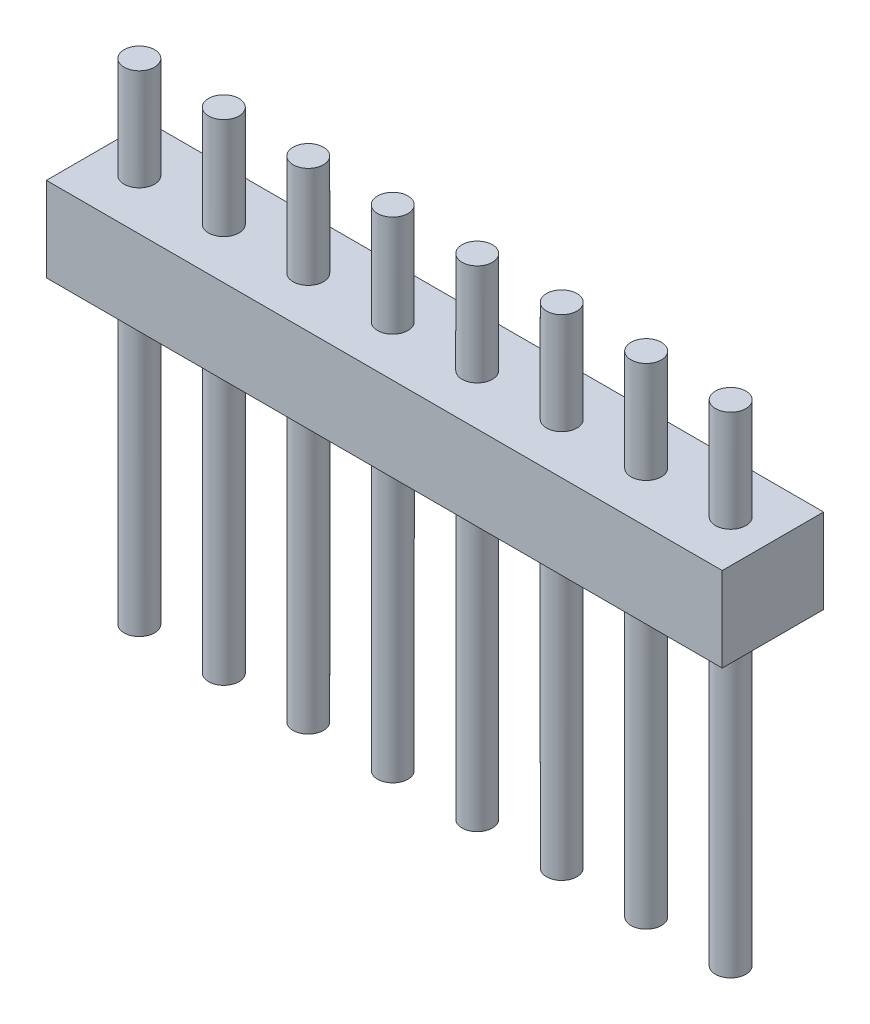
ISO-10303-21;
HEADER;
FILE_DESCRIPTION(('STEP AP214'),'2;1');
FILE_NAME('part.step','',(''),(''),'','','');
FILE_SCHEMA(('AUTOMOTIVE_DESIGN { 1 0 10303 214 1 1 1 1 }'));
ENDSEC;
DATA;
#1=APPLICATION_CONTEXT('core data for automotive mechanical design processes');
#2=APPLICATION_PROTOCOL_DEFINITION('international standard','automotive_design',2000,#1);
#3=PRODUCT_CONTEXT('',#1,'mechanical');
#4=PRODUCT('Part','Part','',(#3));
#5=PRODUCT_RELATED_PRODUCT_CATEGORY('part','',(#4));
#6=PRODUCT_DEFINITION_FORMATION('','',#4);
#7=PRODUCT_DEFINITION_CONTEXT('part definition',#1,'design');
#8=PRODUCT_DEFINITION('design','',#6,#7);
#9=PRODUCT_DEFINITION_SHAPE('','',#8);
#10=(LENGTH_UNIT() NAMED_UNIT(*) SI_UNIT(.MILLI.,.METRE.));
#11=(NAMED_UNIT(*) PLANE_ANGLE_UNIT() SI_UNIT($,.RADIAN.));
#12=(NAMED_UNIT(*) SI_UNIT($,.STERADIAN.) SOLID_ANGLE_UNIT());
#13=UNCERTAINTY_MEASURE_WITH_UNIT(LENGTH_MEASURE(1.E-05),#10,'distance_accuracy_value','');
#14=(GEOMETRIC_REPRESENTATION_CONTEXT(3) GLOBAL_UNCERTAINTY_ASSIGNED_CONTEXT((#13)) GLOBAL_UNIT_ASSIGNED_CONTEXT((#10,
#11,#12)) REPRESENTATION_CONTEXT('',''));
#15=CARTESIAN_POINT('',(0.,0.,0.));
#16=DIRECTION('',(0.,0.,1.));
#17=DIRECTION('',(1.,0.,0.));
#18=AXIS2_PLACEMENT_3D('',#15,#16,#17);
#19=CARTESIAN_POINT('',(10.,1.25,3.));
#20=DIRECTION('',(-1.,0.,0.));
#21=DIRECTION('',(0.,0.,1.));
#22=AXIS2_PLACEMENT_3D('',#19,#20,#21);
#23=PLANE('',#22);
#24=DIRECTION('',(0.,1.,0.));
#25=VECTOR('',#24,1.);
#26=CARTESIAN_POINT('',(10.,1.25,0.));
#27=LINE('',#26,#25);
#28=CARTESIAN_POINT('',(10.,-1.25,0.));
#29=VERTEX_POINT('',#28);
#30=CARTESIAN_POINT('',(10.,1.25,0.));
#31=VERTEX_POINT('',#30);
#32=EDGE_CURVE('E100',#29,#31,#27,.T.);
#33=ORIENTED_EDGE('',*,*,#32,.T.);
#34=DIRECTION('',(0.,0.,-1.));
#35=VECTOR('',#34,1.);
#36=CARTESIAN_POINT('',(10.,1.25,3.));
#37=LINE('',#36,#35);
#38=CARTESIAN_POINT('',(10.,1.25,3.));
#39=VERTEX_POINT('',#38);
#40=EDGE_CURVE('E91',#39,#31,#37,.T.);
#41=ORIENTED_EDGE('',*,*,#40,.F.);
#42=DIRECTION('',(0.,1.,0.));
#43=VECTOR('',#42,1.);
#44=CARTESIAN_POINT('',(10.,1.25,3.));
#45=LINE('',#44,#43);
#46=CARTESIAN_POINT('',(10.,-1.25,3.));
#47=VERTEX_POINT('',#46);
#48=EDGE_CURVE('E85',#47,#39,#45,.T.);
#49=ORIENTED_EDGE('',*,*,#48,.F.);
#50=DIRECTION('',(0.,0.,-1.));
#51=VECTOR('',#50,1.);
#52=CARTESIAN_POINT('',(10.,-1.25,3.));
#53=LINE('',#52,#51);
#54=EDGE_CURVE('E96',#47,#29,#53,.T.);
#55=ORIENTED_EDGE('',*,*,#54,.T.);
#56=EDGE_LOOP('',(#33,#41,#49,#55));
#57=FACE_BOUND('',#56,.T.);
#58=ADVANCED_FACE('F33',(#57),#23,.F.);
#59=CARTESIAN_POINT('',(-10.,1.25,3.));
#60=DIRECTION('',(0.,-1.,0.));
#61=DIRECTION('',(0.,0.,-1.));
#62=AXIS2_PLACEMENT_3D('',#59,#60,#61);
#63=PLANE('',#62);
#64=CARTESIAN_POINT('',(8.75,1.25,1.5));
#65=DIRECTION('',(0.,-1.,0.));
#66=DIRECTION('',(0.,0.,-1.));
#67=AXIS2_PLACEMENT_3D('',#64,#65,#66);
#68=CIRCLE('',#67,0.45);
#69=CARTESIAN_POINT('',(8.75,1.25,1.05));
#70=VERTEX_POINT('',#69);
#71=EDGE_CURVE('E131',#70,#70,#68,.F.);
#72=ORIENTED_EDGE('',*,*,#71,.F.);
#73=EDGE_LOOP('',(#72));
#74=FACE_BOUND('',#73,.T.);
#75=CARTESIAN_POINT('',(6.25,1.25,1.5));
#76=DIRECTION('',(0.,-1.,0.));
#77=DIRECTION('',(0.,0.,-1.));
#78=AXIS2_PLACEMENT_3D('',#75,#76,#77);
#79=CIRCLE('',#78,0.45);
#80=CARTESIAN_POINT('',(6.25,1.25,1.05));
#81=VERTEX_POINT('',#80);
#82=EDGE_CURVE('E128',#81,#81,#79,.F.);
#83=ORIENTED_EDGE('',*,*,#82,.F.);
#84=EDGE_LOOP('',(#83));
#85=FACE_BOUND('',#84,.T.);
#86=CARTESIAN_POINT('',(3.75,1.25,1.5));
#87=DIRECTION('',(0.,-1.,0.));
#88=DIRECTION('',(0.,0.,-1.));
#89=AXIS2_PLACEMENT_3D('',#86,#87,#88);
#90=CIRCLE('',#89,0.45);
#91=CARTESIAN_POINT('',(3.75,1.25,1.05));
#92=VERTEX_POINT('',#91);
#93=EDGE_CURVE('E125',#92,#92,#90,.F.);
#94=ORIENTED_EDGE('',*,*,#93,.F.);
#95=EDGE_LOOP('',(#94));
#96=FACE_BOUND('',#95,.T.);
#97=CARTESIAN_POINT('',(1.25,1.25,1.5));
#98=DIRECTION('',(0.,-1.,0.));
#99=DIRECTION('',(0.,0.,-1.));
#100=AXIS2_PLACEMENT_3D('',#97,#98,#99);
#101=CIRCLE('',#100,0.45);
#102=CARTESIAN_POINT('',(1.25,1.25,1.05));
#103=VERTEX_POINT('',#102);
#104=EDGE_CURVE('E122',#103,#103,#101,.F.);
#105=ORIENTED_EDGE('',*,*,#104,.F.);
#106=EDGE_LOOP('',(#105));
#107=FACE_BOUND('',#106,.T.);
#108=CARTESIAN_POINT('',(-1.25,1.25,1.5));
#109=DIRECTION('',(0.,-1.,0.));
#110=DIRECTION('',(0.,0.,-1.));
#111=AXIS2_PLACEMENT_3D('',#108,#109,#110);
#112=CIRCLE('',#111,0.45);
#113=CARTESIAN_POINT('',(-1.25,1.25,1.05));
#114=VERTEX_POINT('',#113);
#115=EDGE_CURVE('E119',#114,#114,#112,.F.);
#116=ORIENTED_EDGE('',*,*,#115,.F.);
#117=EDGE_LOOP('',(#116));
#118=FACE_BOUND('',#117,.T.);
#119=CARTESIAN_POINT('',(-3.75,1.25,1.5));
#120=DIRECTION('',(0.,-1.,0.));
#121=DIRECTION('',(0.,0.,-1.));
#122=AXIS2_PLACEMENT_3D('',#119,#120,#121);
#123=CIRCLE('',#122,0.45);
#124=CARTESIAN_POINT('',(-3.75,1.25,1.05));
#125=VERTEX_POINT('',#124);
#126=EDGE_CURVE('E116',#125,#125,#123,.F.);
#127=ORIENTED_EDGE('',*,*,#126,.F.);
#128=EDGE_LOOP('',(#127));
#129=FACE_BOUND('',#128,.T.);
#130=CARTESIAN_POINT('',(-6.25,1.25,1.5));
#131=DIRECTION('',(0.,-1.,0.));
#132=DIRECTION('',(0.,0.,-1.));
#133=AXIS2_PLACEMENT_3D('',#130,#131,#132);
#134=CIRCLE('',#133,0.45);
#135=CARTESIAN_POINT('',(-6.25,1.25,1.05));
#136=VERTEX_POINT('',#135);
#137=EDGE_CURVE('E113',#136,#136,#134,.F.);
#138=ORIENTED_EDGE('',*,*,#137,.F.);
#139=EDGE_LOOP('',(#138));
#140=FACE_BOUND('',#139,.T.);
#141=CARTESIAN_POINT('',(-8.75,1.25,1.5));
#142=DIRECTION('',(0.,-1.,0.));
#143=DIRECTION('',(0.,0.,-1.));
#144=AXIS2_PLACEMENT_3D('',#141,#142,#143);
#145=CIRCLE('',#144,0.45);
#146=CARTESIAN_POINT('',(-8.75,1.25,1.05));
#147=VERTEX_POINT('',#146);
#148=EDGE_CURVE('E110',#147,#147,#145,.F.);
#149=ORIENTED_EDGE('',*,*,#148,.F.);
#150=EDGE_LOOP('',(#149));
#151=FACE_BOUND('',#150,.T.);
#152=DIRECTION('',(-1.,0.,0.));
#153=VECTOR('',#152,1.);
#154=CARTESIAN_POINT('',(-10.,1.25,0.));
#155=LINE('',#154,#153);
#156=CARTESIAN_POINT('',(-10.,1.25,0.));
#157=VERTEX_POINT('',#156);
#158=EDGE_CURVE('E90',#31,#157,#155,.T.);
#159=ORIENTED_EDGE('',*,*,#158,.T.);
#160=DIRECTION('',(0.,0.,-1.));
#161=VECTOR('',#160,1.);
#162=CARTESIAN_POINT('',(-10.,1.25,3.));
#163=LINE('',#162,#161);
#164=CARTESIAN_POINT('',(-10.,1.25,3.));
#165=VERTEX_POINT('',#164);
#166=EDGE_CURVE('E88',#165,#157,#163,.T.);
#167=ORIENTED_EDGE('',*,*,#166,.F.);
#168=DIRECTION('',(-1.,0.,0.));
#169=VECTOR('',#168,1.);
#170=CARTESIAN_POINT('',(-10.,1.25,3.));
#171=LINE('',#170,#169);
#172=EDGE_CURVE('E80',#39,#165,#171,.T.);
#173=ORIENTED_EDGE('',*,*,#172,.F.);
#174=ORIENTED_EDGE('',*,*,#40,.T.);
#175=EDGE_LOOP('',(#159,#167,#173,#174));
#176=FACE_BOUND('',#175,.T.);
#177=ADVANCED_FACE('F89',(#74,#85,#96,#107,#118,#129,#140,#151,#176),#63,.F.);
#178=CARTESIAN_POINT('',(-10.,1.25,3.));
#179=DIRECTION('',(1.,0.,0.));
#180=DIRECTION('',(0.,0.,-1.));
#181=AXIS2_PLACEMENT_3D('',#178,#179,#180);
#182=PLANE('',#181);
#183=DIRECTION('',(0.,-1.,0.));
#184=VECTOR('',#183,1.);
#185=CARTESIAN_POINT('',(-10.,1.25,0.));
#186=LINE('',#185,#184);
#187=CARTESIAN_POINT('',(-10.,-1.25,0.));
#188=VERTEX_POINT('',#187);
#189=EDGE_CURVE('E66',#157,#188,#186,.T.);
#190=ORIENTED_EDGE('',*,*,#189,.T.);
#191=DIRECTION('',(0.,0.,-1.));
#192=VECTOR('',#191,1.);
#193=CARTESIAN_POINT('',(-10.,-1.25,3.));
#194=LINE('',#193,#192);
#195=CARTESIAN_POINT('',(-10.,-1.25,3.));
#196=VERTEX_POINT('',#195);
#197=EDGE_CURVE('E92',#196,#188,#194,.T.);
#198=ORIENTED_EDGE('',*,*,#197,.F.);
#199=DIRECTION('',(0.,-1.,0.));
#200=VECTOR('',#199,1.);
#201=CARTESIAN_POINT('',(-10.,1.25,3.));
#202=LINE('',#201,#200);
#203=EDGE_CURVE('E83',#165,#196,#202,.T.);
#204=ORIENTED_EDGE('',*,*,#203,.F.);
#205=ORIENTED_EDGE('',*,*,#166,.T.);
#206=EDGE_LOOP('',(#190,#198,#204,#205));
#207=FACE_BOUND('',#206,.T.);
#208=ADVANCED_FACE('F94',(#207),#182,.F.);
#209=CARTESIAN_POINT('',(-10.,-1.25,3.));
#210=DIRECTION('',(0.,1.,0.));
#211=DIRECTION('',(0.,0.,1.));
#212=AXIS2_PLACEMENT_3D('',#209,#210,#211);
#213=PLANE('',#212);
#214=CARTESIAN_POINT('',(8.75,-1.25,1.5));
#215=DIRECTION('',(0.,1.,0.));
#216=DIRECTION('',(0.,0.,1.));
#217=AXIS2_PLACEMENT_3D('',#214,#215,#216);
#218=CIRCLE('',#217,0.45);
#219=CARTESIAN_POINT('',(8.75,-1.25,1.95));
#220=VERTEX_POINT('',#219);
#221=EDGE_CURVE('E11',#220,#220,#218,.F.);
#222=ORIENTED_EDGE('',*,*,#221,.F.);
#223=EDGE_LOOP('',(#222));
#224=FACE_BOUND('',#223,.T.);
#225=CARTESIAN_POINT('',(6.25,-1.25,1.5));
#226=DIRECTION('',(0.,1.,0.));
#227=DIRECTION('',(0.,0.,1.));
#228=AXIS2_PLACEMENT_3D('',#225,#226,#227);
#229=CIRCLE('',#228,0.45);
#230=CARTESIAN_POINT('',(6.25,-1.25,1.95));
#231=VERTEX_POINT('',#230);
#232=EDGE_CURVE('E41',#231,#231,#229,.F.);
#233=ORIENTED_EDGE('',*,*,#232,.F.);
#234=EDGE_LOOP('',(#233));
#235=FACE_BOUND('',#234,.T.);
#236=CARTESIAN_POINT('',(3.75,-1.25,1.5));
#237=DIRECTION('',(0.,1.,0.));
#238=DIRECTION('',(0.,0.,1.));
#239=AXIS2_PLACEMENT_3D('',#236,#237,#238);
#240=CIRCLE('',#239,0.45);
#241=CARTESIAN_POINT('',(3.75,-1.25,1.95));
#242=VERTEX_POINT('',#241);
#243=EDGE_CURVE('E149',#242,#242,#240,.F.);
#244=ORIENTED_EDGE('',*,*,#243,.F.);
#245=EDGE_LOOP('',(#244));
#246=FACE_BOUND('',#245,.T.);
#247=CARTESIAN_POINT('',(1.25,-1.25,1.5));
#248=DIRECTION('',(0.,1.,0.));
#249=DIRECTION('',(0.,0.,1.));
#250=AXIS2_PLACEMENT_3D('',#247,#248,#249);
#251=CIRCLE('',#250,0.45);
#252=CARTESIAN_POINT('',(1.25,-1.25,1.95));
#253=VERTEX_POINT('',#252);
#254=EDGE_CURVE('E146',#253,#253,#251,.F.);
#255=ORIENTED_EDGE('',*,*,#254,.F.);
#256=EDGE_LOOP('',(#255));
#257=FACE_BOUND('',#256,.T.);
#258=CARTESIAN_POINT('',(-1.25,-1.25,1.5));
#259=DIRECTION('',(0.,1.,0.));
#260=DIRECTION('',(0.,0.,1.));
#261=AXIS2_PLACEMENT_3D('',#258,#259,#260);
#262=CIRCLE('',#261,0.45);
#263=CARTESIAN_POINT('',(-1.25,-1.25,1.95));
#264=VERTEX_POINT('',#263);
#265=EDGE_CURVE('E143',#264,#264,#262,.F.);
#266=ORIENTED_EDGE('',*,*,#265,.F.);
#267=EDGE_LOOP('',(#266));
#268=FACE_BOUND('',#267,.T.);
#269=CARTESIAN_POINT('',(-3.75,-1.25,1.5));
#270=DIRECTION('',(0.,1.,0.));
#271=DIRECTION('',(0.,0.,1.));
#272=AXIS2_PLACEMENT_3D('',#269,#270,#271);
#273=CIRCLE('',#272,0.45);
#274=CARTESIAN_POINT('',(-3.75,-1.25,1.95));
#275=VERTEX_POINT('',#274);
#276=EDGE_CURVE('E140',#275,#275,#273,.F.);
#277=ORIENTED_EDGE('',*,*,#276,.F.);
#278=EDGE_LOOP('',(#277));
#279=FACE_BOUND('',#278,.T.);
#280=CARTESIAN_POINT('',(-6.25,-1.25,1.5));
#281=DIRECTION('',(0.,1.,0.));
#282=DIRECTION('',(0.,0.,1.));
#283=AXIS2_PLACEMENT_3D('',#280,#281,#282);
#284=CIRCLE('',#283,0.45);
#285=CARTESIAN_POINT('',(-6.25,-1.25,1.95));
#286=VERTEX_POINT('',#285);
#287=EDGE_CURVE('E137',#286,#286,#284,.F.);
#288=ORIENTED_EDGE('',*,*,#287,.F.);
#289=EDGE_LOOP('',(#288));
#290=FACE_BOUND('',#289,.T.);
#291=CARTESIAN_POINT('',(-8.75,-1.25,1.5));
#292=DIRECTION('',(0.,1.,0.));
#293=DIRECTION('',(0.,0.,1.));
#294=AXIS2_PLACEMENT_3D('',#291,#292,#293);
#295=CIRCLE('',#294,0.45);
#296=CARTESIAN_POINT('',(-8.75,-1.25,1.95));
#297=VERTEX_POINT('',#296);
#298=EDGE_CURVE('E134',#297,#297,#295,.F.);
#299=ORIENTED_EDGE('',*,*,#298,.F.);
#300=EDGE_LOOP('',(#299));
#301=FACE_BOUND('',#300,.T.);
#302=DIRECTION('',(1.,0.,0.));
#303=VECTOR('',#302,1.);
#304=CARTESIAN_POINT('',(-10.,-1.25,0.));
#305=LINE('',#304,#303);
#306=EDGE_CURVE('E72',#188,#29,#305,.T.);
#307=ORIENTED_EDGE('',*,*,#306,.T.);
#308=ORIENTED_EDGE('',*,*,#54,.F.);
#309=DIRECTION('',(1.,0.,0.));
#310=VECTOR('',#309,1.);
#311=CARTESIAN_POINT('',(-10.,-1.25,3.));
#312=LINE('',#311,#310);
#313=EDGE_CURVE('E49',#196,#47,#312,.T.);
#314=ORIENTED_EDGE('',*,*,#313,.F.);
#315=ORIENTED_EDGE('',*,*,#197,.T.);
#316=EDGE_LOOP('',(#307,#308,#314,#315));
#317=FACE_BOUND('',#316,.T.);
#318=ADVANCED_FACE('F156',(#224,#235,#246,#257,#268,#279,#290,#301,#317),#213,.F.);
#319=CARTESIAN_POINT('',(0.,0.,3.));
#320=DIRECTION('',(0.,0.,1.));
#321=DIRECTION('',(1.,0.,0.));
#322=AXIS2_PLACEMENT_3D('',#319,#320,#321);
#323=PLANE('',#322);
#324=ORIENTED_EDGE('',*,*,#48,.T.);
#325=ORIENTED_EDGE('',*,*,#172,.T.);
#326=ORIENTED_EDGE('',*,*,#203,.T.);
#327=ORIENTED_EDGE('',*,*,#313,.T.);
#328=EDGE_LOOP('',(#324,#325,#326,#327));
#329=FACE_BOUND('',#328,.T.);
#330=ADVANCED_FACE('F81',(#329),#323,.T.);
#331=CARTESIAN_POINT('',(0.,0.,0.));
#332=DIRECTION('',(0.,0.,1.));
#333=DIRECTION('',(1.,0.,0.));
#334=AXIS2_PLACEMENT_3D('',#331,#332,#333);
#335=PLANE('',#334);
#336=ORIENTED_EDGE('',*,*,#32,.F.);
#337=ORIENTED_EDGE('',*,*,#306,.F.);
#338=ORIENTED_EDGE('',*,*,#189,.F.);
#339=ORIENTED_EDGE('',*,*,#158,.F.);
#340=EDGE_LOOP('',(#336,#337,#338,#339));
#341=FACE_BOUND('',#340,.T.);
#342=ADVANCED_FACE('F198',(#341),#335,.F.);
#343=CARTESIAN_POINT('',(-8.75,4.25,1.5));
#344=DIRECTION('',(0.,-1.,0.));
#345=DIRECTION('',(0.,0.,-1.));
#346=AXIS2_PLACEMENT_3D('',#343,#344,#345);
#347=CYLINDRICAL_SURFACE('',#346,0.45);
#348=CARTESIAN_POINT('',(-8.75,4.25,1.5));
#349=DIRECTION('',(0.,1.,0.));
#350=DIRECTION('',(0.,0.,1.));
#351=AXIS2_PLACEMENT_3D('',#348,#349,#350);
#352=CIRCLE('',#351,0.45);
#353=CARTESIAN_POINT('',(-8.75,4.25,1.95));
#354=VERTEX_POINT('',#353);
#355=EDGE_CURVE('E103',#354,#354,#352,.T.);
#356=ORIENTED_EDGE('',*,*,#355,.F.);
#357=EDGE_LOOP('',(#356));
#358=FACE_BOUND('',#357,.T.);
#359=ORIENTED_EDGE('',*,*,#148,.T.);
#360=EDGE_LOOP('',(#359));
#361=FACE_BOUND('',#360,.T.);
#362=ADVANCED_FACE('F200',(#358,#361),#347,.T.);
#363=CARTESIAN_POINT('',(-8.75,4.25,1.5));
#364=DIRECTION('',(0.,1.,0.));
#365=DIRECTION('',(0.,0.,1.));
#366=AXIS2_PLACEMENT_3D('',#363,#364,#365);
#367=PLANE('',#366);
#368=ORIENTED_EDGE('',*,*,#355,.T.);
#369=EDGE_LOOP('',(#368));
#370=FACE_BOUND('',#369,.T.);
#371=ADVANCED_FACE('F206',(#370),#367,.T.);
#372=CARTESIAN_POINT('',(-6.25,4.25,1.5));
#373=DIRECTION('',(0.,-1.,0.));
#374=DIRECTION('',(0.,0.,-1.));
#375=AXIS2_PLACEMENT_3D('',#372,#373,#374);
#376=CYLINDRICAL_SURFACE('',#375,0.45);
#377=CARTESIAN_POINT('',(-6.25,4.25,1.5));
#378=DIRECTION('',(0.,1.,0.));
#379=DIRECTION('',(0.,0.,1.));
#380=AXIS2_PLACEMENT_3D('',#377,#378,#379);
#381=CIRCLE('',#380,0.45);
#382=CARTESIAN_POINT('',(-6.25,4.25,1.95));
#383=VERTEX_POINT('',#382);
#384=EDGE_CURVE('E579',#383,#383,#381,.T.);
#385=ORIENTED_EDGE('',*,*,#384,.F.);
#386=EDGE_LOOP('',(#385));
#387=FACE_BOUND('',#386,.T.);
#388=ORIENTED_EDGE('',*,*,#137,.T.);
#389=EDGE_LOOP('',(#388));
#390=FACE_BOUND('',#389,.T.);
#391=ADVANCED_FACE('F249',(#387,#390),#376,.T.);
#392=CARTESIAN_POINT('',(-6.25,4.25,1.5));
#393=DIRECTION('',(0.,1.,0.));
#394=DIRECTION('',(0.,0.,1.));
#395=AXIS2_PLACEMENT_3D('',#392,#393,#394);
#396=PLANE('',#395);
#397=ORIENTED_EDGE('',*,*,#384,.T.);
#398=EDGE_LOOP('',(#397));
#399=FACE_BOUND('',#398,.T.);
#400=ADVANCED_FACE('F259',(#399),#396,.T.);
#401=CARTESIAN_POINT('',(-3.75,4.25,1.5));
#402=DIRECTION('',(0.,-1.,0.));
#403=DIRECTION('',(0.,0.,-1.));
#404=AXIS2_PLACEMENT_3D('',#401,#402,#403);
#405=CYLINDRICAL_SURFACE('',#404,0.45);
#406=CARTESIAN_POINT('',(-3.75,4.25,1.5));
#407=DIRECTION('',(0.,1.,0.));
#408=DIRECTION('',(0.,0.,1.));
#409=AXIS2_PLACEMENT_3D('',#406,#407,#408);
#410=CIRCLE('',#409,0.45);
#411=CARTESIAN_POINT('',(-3.75,4.25,1.95));
#412=VERTEX_POINT('',#411);
#413=EDGE_CURVE('E576',#412,#412,#410,.T.);
#414=ORIENTED_EDGE('',*,*,#413,.F.);
#415=EDGE_LOOP('',(#414));
#416=FACE_BOUND('',#415,.T.);
#417=ORIENTED_EDGE('',*,*,#126,.T.);
#418=EDGE_LOOP('',(#417));
#419=FACE_BOUND('',#418,.T.);
#420=ADVANCED_FACE('F269',(#416,#419),#405,.T.);
#421=CARTESIAN_POINT('',(-3.75,4.25,1.5));
#422=DIRECTION('',(0.,1.,0.));
#423=DIRECTION('',(0.,0.,1.));
#424=AXIS2_PLACEMENT_3D('',#421,#422,#423);
#425=PLANE('',#424);
#426=ORIENTED_EDGE('',*,*,#413,.T.);
#427=EDGE_LOOP('',(#426));
#428=FACE_BOUND('',#427,.T.);
#429=ADVANCED_FACE('F279',(#428),#425,.T.);
#430=CARTESIAN_POINT('',(-1.25,4.25,1.5));
#431=DIRECTION('',(0.,-1.,0.));
#432=DIRECTION('',(0.,0.,-1.));
#433=AXIS2_PLACEMENT_3D('',#430,#431,#432);
#434=CYLINDRICAL_SURFACE('',#433,0.45);
#435=CARTESIAN_POINT('',(-1.25,4.25,1.5));
#436=DIRECTION('',(0.,1.,0.));
#437=DIRECTION('',(0.,0.,1.));
#438=AXIS2_PLACEMENT_3D('',#435,#436,#437);
#439=CIRCLE('',#438,0.45);
#440=CARTESIAN_POINT('',(-1.25,4.25,1.95));
#441=VERTEX_POINT('',#440);
#442=EDGE_CURVE('E573',#441,#441,#439,.T.);
#443=ORIENTED_EDGE('',*,*,#442,.F.);
#444=EDGE_LOOP('',(#443));
#445=FACE_BOUND('',#444,.T.);
#446=ORIENTED_EDGE('',*,*,#115,.T.);
#447=EDGE_LOOP('',(#446));
#448=FACE_BOUND('',#447,.T.);
#449=ADVANCED_FACE('F289',(#445,#448),#434,.T.);
#450=CARTESIAN_POINT('',(-1.25,4.25,1.5));
#451=DIRECTION('',(0.,1.,0.));
#452=DIRECTION('',(0.,0.,1.));
#453=AXIS2_PLACEMENT_3D('',#450,#451,#452);
#454=PLANE('',#453);
#455=ORIENTED_EDGE('',*,*,#442,.T.);
#456=EDGE_LOOP('',(#455));
#457=FACE_BOUND('',#456,.T.);
#458=ADVANCED_FACE('F299',(#457),#454,.T.);
#459=CARTESIAN_POINT('',(1.25,4.25,1.5));
#460=DIRECTION('',(0.,-1.,0.));
#461=DIRECTION('',(0.,0.,-1.));
#462=AXIS2_PLACEMENT_3D('',#459,#460,#461);
#463=CYLINDRICAL_SURFACE('',#462,0.45);
#464=CARTESIAN_POINT('',(1.25,4.25,1.5));
#465=DIRECTION('',(0.,1.,0.));
#466=DIRECTION('',(0.,0.,1.));
#467=AXIS2_PLACEMENT_3D('',#464,#465,#466);
#468=CIRCLE('',#467,0.45);
#469=CARTESIAN_POINT('',(1.25,4.25,1.95));
#470=VERTEX_POINT('',#469);
#471=EDGE_CURVE('E570',#470,#470,#468,.T.);
#472=ORIENTED_EDGE('',*,*,#471,.F.);
#473=EDGE_LOOP('',(#472));
#474=FACE_BOUND('',#473,.T.);
#475=ORIENTED_EDGE('',*,*,#104,.T.);
#476=EDGE_LOOP('',(#475));
#477=FACE_BOUND('',#476,.T.);
#478=ADVANCED_FACE('F309',(#474,#477),#463,.T.);
#479=CARTESIAN_POINT('',(1.25,4.25,1.5));
#480=DIRECTION('',(0.,1.,0.));
#481=DIRECTION('',(0.,0.,1.));
#482=AXIS2_PLACEMENT_3D('',#479,#480,#481);
#483=PLANE('',#482);
#484=ORIENTED_EDGE('',*,*,#471,.T.);
#485=EDGE_LOOP('',(#484));
#486=FACE_BOUND('',#485,.T.);
#487=ADVANCED_FACE('F319',(#486),#483,.T.);
#488=CARTESIAN_POINT('',(3.75,4.25,1.5));
#489=DIRECTION('',(0.,-1.,0.));
#490=DIRECTION('',(0.,0.,-1.));
#491=AXIS2_PLACEMENT_3D('',#488,#489,#490);
#492=CYLINDRICAL_SURFACE('',#491,0.45);
#493=CARTESIAN_POINT('',(3.75,4.25,1.5));
#494=DIRECTION('',(0.,1.,0.));
#495=DIRECTION('',(0.,0.,1.));
#496=AXIS2_PLACEMENT_3D('',#493,#494,#495);
#497=CIRCLE('',#496,0.45);
#498=CARTESIAN_POINT('',(3.75,4.25,1.95));
#499=VERTEX_POINT('',#498);
#500=EDGE_CURVE('E567',#499,#499,#497,.T.);
#501=ORIENTED_EDGE('',*,*,#500,.F.);
#502=EDGE_LOOP('',(#501));
#503=FACE_BOUND('',#502,.T.);
#504=ORIENTED_EDGE('',*,*,#93,.T.);
#505=EDGE_LOOP('',(#504));
#506=FACE_BOUND('',#505,.T.);
#507=ADVANCED_FACE('F329',(#503,#506),#492,.T.);
#508=CARTESIAN_POINT('',(3.75,4.25,1.5));
#509=DIRECTION('',(0.,1.,0.));
#510=DIRECTION('',(0.,0.,1.));
#511=AXIS2_PLACEMENT_3D('',#508,#509,#510);
#512=PLANE('',#511);
#513=ORIENTED_EDGE('',*,*,#500,.T.);
#514=EDGE_LOOP('',(#513));
#515=FACE_BOUND('',#514,.T.);
#516=ADVANCED_FACE('F339',(#515),#512,.T.);
#517=CARTESIAN_POINT('',(6.25,4.25,1.5));
#518=DIRECTION('',(0.,-1.,0.));
#519=DIRECTION('',(0.,0.,-1.));
#520=AXIS2_PLACEMENT_3D('',#517,#518,#519);
#521=CYLINDRICAL_SURFACE('',#520,0.45);
#522=CARTESIAN_POINT('',(6.25,4.25,1.5));
#523=DIRECTION('',(0.,1.,0.));
#524=DIRECTION('',(0.,0.,1.));
#525=AXIS2_PLACEMENT_3D('',#522,#523,#524);
#526=CIRCLE('',#525,0.45);
#527=CARTESIAN_POINT('',(6.25,4.25,1.95));
#528=VERTEX_POINT('',#527);
#529=EDGE_CURVE('E564',#528,#528,#526,.T.);
#530=ORIENTED_EDGE('',*,*,#529,.F.);
#531=EDGE_LOOP('',(#530));
#532=FACE_BOUND('',#531,.T.);
#533=ORIENTED_EDGE('',*,*,#82,.T.);
#534=EDGE_LOOP('',(#533));
#535=FACE_BOUND('',#534,.T.);
#536=ADVANCED_FACE('F349',(#532,#535),#521,.T.);
#537=CARTESIAN_POINT('',(6.25,4.25,1.5));
#538=DIRECTION('',(0.,1.,0.));
#539=DIRECTION('',(0.,0.,1.));
#540=AXIS2_PLACEMENT_3D('',#537,#538,#539);
#541=PLANE('',#540);
#542=ORIENTED_EDGE('',*,*,#529,.T.);
#543=EDGE_LOOP('',(#542));
#544=FACE_BOUND('',#543,.T.);
#545=ADVANCED_FACE('F359',(#544),#541,.T.);
#546=CARTESIAN_POINT('',(8.75,4.25,1.5));
#547=DIRECTION('',(0.,-1.,0.));
#548=DIRECTION('',(0.,0.,-1.));
#549=AXIS2_PLACEMENT_3D('',#546,#547,#548);
#550=CYLINDRICAL_SURFACE('',#549,0.45);
#551=CARTESIAN_POINT('',(8.75,4.25,1.5));
#552=DIRECTION('',(0.,1.,0.));
#553=DIRECTION('',(0.,0.,1.));
#554=AXIS2_PLACEMENT_3D('',#551,#552,#553);
#555=CIRCLE('',#554,0.45);
#556=CARTESIAN_POINT('',(8.75,4.25,1.95));
#557=VERTEX_POINT('',#556);
#558=EDGE_CURVE('E561',#557,#557,#555,.T.);
#559=ORIENTED_EDGE('',*,*,#558,.F.);
#560=EDGE_LOOP('',(#559));
#561=FACE_BOUND('',#560,.T.);
#562=ORIENTED_EDGE('',*,*,#71,.T.);
#563=EDGE_LOOP('',(#562));
#564=FACE_BOUND('',#563,.T.);
#565=ADVANCED_FACE('F186',(#561,#564),#550,.T.);
#566=CARTESIAN_POINT('',(8.75,4.25,1.5));
#567=DIRECTION('',(0.,1.,0.));
#568=DIRECTION('',(0.,0.,1.));
#569=AXIS2_PLACEMENT_3D('',#566,#567,#568);
#570=PLANE('',#569);
#571=ORIENTED_EDGE('',*,*,#558,.T.);
#572=EDGE_LOOP('',(#571));
#573=FACE_BOUND('',#572,.T.);
#574=ADVANCED_FACE('F176',(#573),#570,.T.);
#575=CARTESIAN_POINT('',(-8.75,-10.25,1.5));
#576=DIRECTION('',(0.,1.,0.));
#577=DIRECTION('',(0.,0.,1.));
#578=AXIS2_PLACEMENT_3D('',#575,#576,#577);
#579=CYLINDRICAL_SURFACE('',#578,0.45);
#580=CARTESIAN_POINT('',(-8.75,-10.25,1.5));
#581=DIRECTION('',(0.,-1.,0.));
#582=DIRECTION('',(0.,0.,-1.));
#583=AXIS2_PLACEMENT_3D('',#580,#581,#582);
#584=CIRCLE('',#583,0.45);
#585=CARTESIAN_POINT('',(-8.75,-10.25,1.05));
#586=VERTEX_POINT('',#585);
#587=EDGE_CURVE('E558',#586,#586,#584,.T.);
#588=ORIENTED_EDGE('',*,*,#587,.F.);
#589=EDGE_LOOP('',(#588));
#590=FACE_BOUND('',#589,.T.);
#591=ORIENTED_EDGE('',*,*,#298,.T.);
#592=EDGE_LOOP('',(#591));
#593=FACE_BOUND('',#592,.T.);
#594=ADVANCED_FACE('F173',(#590,#593),#579,.T.);
#595=CARTESIAN_POINT('',(-8.75,-10.25,1.5));
#596=DIRECTION('',(0.,-1.,0.));
#597=DIRECTION('',(0.,0.,-1.));
#598=AXIS2_PLACEMENT_3D('',#595,#596,#597);
#599=PLANE('',#598);
#600=ORIENTED_EDGE('',*,*,#587,.T.);
#601=EDGE_LOOP('',(#600));
#602=FACE_BOUND('',#601,.T.);
#603=ADVANCED_FACE('F175',(#602),#599,.T.);
#604=CARTESIAN_POINT('',(-6.25,-10.25,1.5));
#605=DIRECTION('',(0.,1.,0.));
#606=DIRECTION('',(0.,0.,1.));
#607=AXIS2_PLACEMENT_3D('',#604,#605,#606);
#608=CYLINDRICAL_SURFACE('',#607,0.45);
#609=CARTESIAN_POINT('',(-6.25,-10.25,1.5));
#610=DIRECTION('',(0.,-1.,0.));
#611=DIRECTION('',(0.,0.,-1.));
#612=AXIS2_PLACEMENT_3D('',#609,#610,#611);
#613=CIRCLE('',#612,0.45);
#614=CARTESIAN_POINT('',(-6.25,-10.25,1.05));
#615=VERTEX_POINT('',#614);
#616=EDGE_CURVE('E555',#615,#615,#613,.T.);
#617=ORIENTED_EDGE('',*,*,#616,.F.);
#618=EDGE_LOOP('',(#617));
#619=FACE_BOUND('',#618,.T.);
#620=ORIENTED_EDGE('',*,*,#287,.T.);
#621=EDGE_LOOP('',(#620));
#622=FACE_BOUND('',#621,.T.);
#623=ADVANCED_FACE('F183',(#619,#622),#608,.T.);
#624=CARTESIAN_POINT('',(-6.25,-10.25,1.5));
#625=DIRECTION('',(0.,-1.,0.));
#626=DIRECTION('',(0.,0.,-1.));
#627=AXIS2_PLACEMENT_3D('',#624,#625,#626);
#628=PLANE('',#627);
#629=ORIENTED_EDGE('',*,*,#616,.T.);
#630=EDGE_LOOP('',(#629));
#631=FACE_BOUND('',#630,.T.);
#632=ADVANCED_FACE('F402',(#631),#628,.T.);
#633=CARTESIAN_POINT('',(-3.75,-10.25,1.5));
#634=DIRECTION('',(0.,1.,0.));
#635=DIRECTION('',(0.,0.,1.));
#636=AXIS2_PLACEMENT_3D('',#633,#634,#635);
#637=CYLINDRICAL_SURFACE('',#636,0.45);
#638=CARTESIAN_POINT('',(-3.75,-10.25,1.5));
#639=DIRECTION('',(0.,-1.,0.));
#640=DIRECTION('',(0.,0.,-1.));
#641=AXIS2_PLACEMENT_3D('',#638,#639,#640);
#642=CIRCLE('',#641,0.45);
#643=CARTESIAN_POINT('',(-3.75,-10.25,1.05));
#644=VERTEX_POINT('',#643);
#645=EDGE_CURVE('E552',#644,#644,#642,.T.);
#646=ORIENTED_EDGE('',*,*,#645,.F.);
#647=EDGE_LOOP('',(#646));
#648=FACE_BOUND('',#647,.T.);
#649=ORIENTED_EDGE('',*,*,#276,.T.);
#650=EDGE_LOOP('',(#649));
#651=FACE_BOUND('',#650,.T.);
#652=ADVANCED_FACE('F411',(#648,#651),#637,.T.);
#653=CARTESIAN_POINT('',(-3.75,-10.25,1.5));
#654=DIRECTION('',(0.,-1.,0.));
#655=DIRECTION('',(0.,0.,-1.));
#656=AXIS2_PLACEMENT_3D('',#653,#654,#655);
#657=PLANE('',#656);
#658=ORIENTED_EDGE('',*,*,#645,.T.);
#659=EDGE_LOOP('',(#658));
#660=FACE_BOUND('',#659,.T.);
#661=ADVANCED_FACE('F420',(#660),#657,.T.);
#662=CARTESIAN_POINT('',(-1.25,-10.25,1.5));
#663=DIRECTION('',(0.,1.,0.));
#664=DIRECTION('',(0.,0.,1.));
#665=AXIS2_PLACEMENT_3D('',#662,#663,#664);
#666=CYLINDRICAL_SURFACE('',#665,0.45);
#667=CARTESIAN_POINT('',(-1.25,-10.25,1.5));
#668=DIRECTION('',(0.,-1.,0.));
#669=DIRECTION('',(0.,0.,-1.));
#670=AXIS2_PLACEMENT_3D('',#667,#668,#669);
#671=CIRCLE('',#670,0.45);
#672=CARTESIAN_POINT('',(-1.25,-10.25,1.05));
#673=VERTEX_POINT('',#672);
#674=EDGE_CURVE('E549',#673,#673,#671,.T.);
#675=ORIENTED_EDGE('',*,*,#674,.F.);
#676=EDGE_LOOP('',(#675));
#677=FACE_BOUND('',#676,.T.);
#678=ORIENTED_EDGE('',*,*,#265,.T.);
#679=EDGE_LOOP('',(#678));
#680=FACE_BOUND('',#679,.T.);
#681=ADVANCED_FACE('F429',(#677,#680),#666,.T.);
#682=CARTESIAN_POINT('',(-1.25,-10.25,1.5));
#683=DIRECTION('',(0.,-1.,0.));
#684=DIRECTION('',(0.,0.,-1.));
#685=AXIS2_PLACEMENT_3D('',#682,#683,#684);
#686=PLANE('',#685);
#687=ORIENTED_EDGE('',*,*,#674,.T.);
#688=EDGE_LOOP('',(#687));
#689=FACE_BOUND('',#688,.T.);
#690=ADVANCED_FACE('F438',(#689),#686,.T.);
#691=CARTESIAN_POINT('',(1.25,-10.25,1.5));
#692=DIRECTION('',(0.,1.,0.));
#693=DIRECTION('',(0.,0.,1.));
#694=AXIS2_PLACEMENT_3D('',#691,#692,#693);
#695=CYLINDRICAL_SURFACE('',#694,0.45);
#696=CARTESIAN_POINT('',(1.25,-10.25,1.5));
#697=DIRECTION('',(0.,-1.,0.));
#698=DIRECTION('',(0.,0.,-1.));
#699=AXIS2_PLACEMENT_3D('',#696,#697,#698);
#700=CIRCLE('',#699,0.45);
#701=CARTESIAN_POINT('',(1.25,-10.25,1.05));
#702=VERTEX_POINT('',#701);
#703=EDGE_CURVE('E546',#702,#702,#700,.T.);
#704=ORIENTED_EDGE('',*,*,#703,.F.);
#705=EDGE_LOOP('',(#704));
#706=FACE_BOUND('',#705,.T.);
#707=ORIENTED_EDGE('',*,*,#254,.T.);
#708=EDGE_LOOP('',(#707));
#709=FACE_BOUND('',#708,.T.);
#710=ADVANCED_FACE('F447',(#706,#709),#695,.T.);
#711=CARTESIAN_POINT('',(1.25,-10.25,1.5));
#712=DIRECTION('',(0.,-1.,0.));
#713=DIRECTION('',(0.,0.,-1.));
#714=AXIS2_PLACEMENT_3D('',#711,#712,#713);
#715=PLANE('',#714);
#716=ORIENTED_EDGE('',*,*,#703,.T.);
#717=EDGE_LOOP('',(#716));
#718=FACE_BOUND('',#717,.T.);
#719=ADVANCED_FACE('F456',(#718),#715,.T.);
#720=CARTESIAN_POINT('',(3.75,-10.25,1.5));
#721=DIRECTION('',(0.,1.,0.));
#722=DIRECTION('',(0.,0.,1.));
#723=AXIS2_PLACEMENT_3D('',#720,#721,#722);
#724=CYLINDRICAL_SURFACE('',#723,0.45);
#725=CARTESIAN_POINT('',(3.75,-10.25,1.5));
#726=DIRECTION('',(0.,-1.,0.));
#727=DIRECTION('',(0.,0.,-1.));
#728=AXIS2_PLACEMENT_3D('',#725,#726,#727);
#729=CIRCLE('',#728,0.45);
#730=CARTESIAN_POINT('',(3.75,-10.25,1.05));
#731=VERTEX_POINT('',#730);
#732=EDGE_CURVE('E541',#731,#731,#729,.T.);
#733=ORIENTED_EDGE('',*,*,#732,.F.);
#734=EDGE_LOOP('',(#733));
#735=FACE_BOUND('',#734,.T.);
#736=ORIENTED_EDGE('',*,*,#243,.T.);
#737=EDGE_LOOP('',(#736));
#738=FACE_BOUND('',#737,.T.);
#739=ADVANCED_FACE('F465',(#735,#738),#724,.T.);
#740=CARTESIAN_POINT('',(3.75,-10.25,1.5));
#741=DIRECTION('',(0.,-1.,0.));
#742=DIRECTION('',(0.,0.,-1.));
#743=AXIS2_PLACEMENT_3D('',#740,#741,#742);
#744=PLANE('',#743);
#745=ORIENTED_EDGE('',*,*,#732,.T.);
#746=EDGE_LOOP('',(#745));
#747=FACE_BOUND('',#746,.T.);
#748=ADVANCED_FACE('F474',(#747),#744,.T.);
#749=CARTESIAN_POINT('',(6.25,-10.25,1.5));
#750=DIRECTION('',(0.,1.,0.));
#751=DIRECTION('',(0.,0.,1.));
#752=AXIS2_PLACEMENT_3D('',#749,#750,#751);
#753=CYLINDRICAL_SURFACE('',#752,0.45);
#754=CARTESIAN_POINT('',(6.25,-10.25,1.5));
#755=DIRECTION('',(0.,-1.,0.));
#756=DIRECTION('',(0.,0.,-1.));
#757=AXIS2_PLACEMENT_3D('',#754,#755,#756);
#758=CIRCLE('',#757,0.45);
#759=CARTESIAN_POINT('',(6.25,-10.25,1.05));
#760=VERTEX_POINT('',#759);
#761=EDGE_CURVE('E538',#760,#760,#758,.T.);
#762=ORIENTED_EDGE('',*,*,#761,.F.);
#763=EDGE_LOOP('',(#762));
#764=FACE_BOUND('',#763,.T.);
#765=ORIENTED_EDGE('',*,*,#232,.T.);
#766=EDGE_LOOP('',(#765));
#767=FACE_BOUND('',#766,.T.);
#768=ADVANCED_FACE('F154',(#764,#767),#753,.T.);
#769=CARTESIAN_POINT('',(6.25,-10.25,1.5));
#770=DIRECTION('',(0.,-1.,0.));
#771=DIRECTION('',(0.,0.,-1.));
#772=AXIS2_PLACEMENT_3D('',#769,#770,#771);
#773=PLANE('',#772);
#774=ORIENTED_EDGE('',*,*,#761,.T.);
#775=EDGE_LOOP('',(#774));
#776=FACE_BOUND('',#775,.T.);
#777=ADVANCED_FACE('F491',(#776),#773,.T.);
#778=CARTESIAN_POINT('',(8.75,-10.25,1.5));
#779=DIRECTION('',(0.,1.,0.));
#780=DIRECTION('',(0.,0.,1.));
#781=AXIS2_PLACEMENT_3D('',#778,#779,#780);
#782=CYLINDRICAL_SURFACE('',#781,0.45);
#783=CARTESIAN_POINT('',(8.75,-10.25,1.5));
#784=DIRECTION('',(0.,-1.,0.));
#785=DIRECTION('',(0.,0.,-1.));
#786=AXIS2_PLACEMENT_3D('',#783,#784,#785);
#787=CIRCLE('',#786,0.45);
#788=CARTESIAN_POINT('',(8.75,-10.25,1.05));
#789=VERTEX_POINT('',#788);
#790=EDGE_CURVE('E537',#789,#789,#787,.T.);
#791=ORIENTED_EDGE('',*,*,#790,.F.);
#792=EDGE_LOOP('',(#791));
#793=FACE_BOUND('',#792,.T.);
#794=ORIENTED_EDGE('',*,*,#221,.T.);
#795=EDGE_LOOP('',(#794));
#796=FACE_BOUND('',#795,.T.);
#797=ADVANCED_FACE('F500',(#793,#796),#782,.T.);
#798=CARTESIAN_POINT('',(8.75,-10.25,1.5));
#799=DIRECTION('',(0.,-1.,0.));
#800=DIRECTION('',(0.,0.,-1.));
#801=AXIS2_PLACEMENT_3D('',#798,#799,#800);
#802=PLANE('',#801);
#803=ORIENTED_EDGE('',*,*,#790,.T.);
#804=EDGE_LOOP('',(#803));
#805=FACE_BOUND('',#804,.T.);
#806=ADVANCED_FACE('F509',(#805),#802,.T.);
#807=CLOSED_SHELL('',(#58,#177,#208,#318,#330,#342,#362,#371,#391,#400,#420,#429,#449,#458,#478,
#487,#507,#516,#536,#545,#565,#574,#594,#603,#623,#632,#652,#661,#681,#690,#710,#719,#739,#748,
#768,#777,#797,#806));
#808=MANIFOLD_SOLID_BREP('B2',#807);
#809=ADVANCED_BREP_SHAPE_REPRESENTATION('',(#18,#808),#14);
#810=SHAPE_DEFINITION_REPRESENTATION(#9,#809);
ENDSEC;
END-ISO-10303-21;
